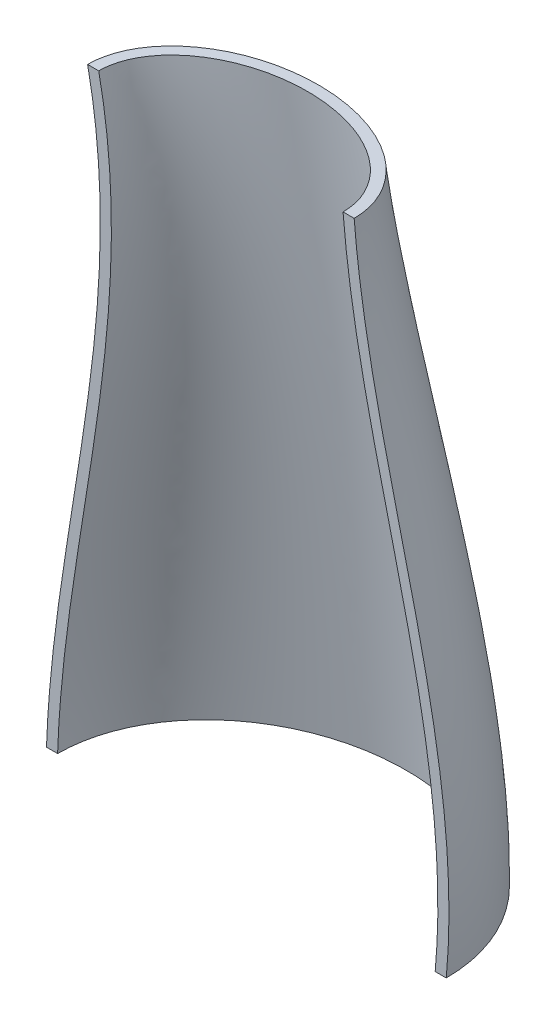
ISO-10303-21;
HEADER;
FILE_DESCRIPTION(('STEP AP214'),'2;1');
FILE_NAME('part.step','',(''),(''),'','','');
FILE_SCHEMA(('AUTOMOTIVE_DESIGN { 1 0 10303 214 1 1 1 1 }'));
ENDSEC;
DATA;
#1=APPLICATION_CONTEXT('core data for automotive mechanical design processes');
#2=APPLICATION_PROTOCOL_DEFINITION('international standard','automotive_design',2000,#1);
#3=PRODUCT_CONTEXT('',#1,'mechanical');
#4=PRODUCT('Part','Part','',(#3));
#5=PRODUCT_RELATED_PRODUCT_CATEGORY('part','',(#4));
#6=PRODUCT_DEFINITION_FORMATION('','',#4);
#7=PRODUCT_DEFINITION_CONTEXT('part definition',#1,'design');
#8=PRODUCT_DEFINITION('design','',#6,#7);
#9=PRODUCT_DEFINITION_SHAPE('','',#8);
#10=(LENGTH_UNIT() NAMED_UNIT(*) SI_UNIT(.MILLI.,.METRE.));
#11=(NAMED_UNIT(*) PLANE_ANGLE_UNIT() SI_UNIT($,.RADIAN.));
#12=(NAMED_UNIT(*) SI_UNIT($,.STERADIAN.) SOLID_ANGLE_UNIT());
#13=UNCERTAINTY_MEASURE_WITH_UNIT(LENGTH_MEASURE(1.E-05),#10,'distance_accuracy_value','');
#14=(GEOMETRIC_REPRESENTATION_CONTEXT(3) GLOBAL_UNCERTAINTY_ASSIGNED_CONTEXT((#13)) GLOBAL_UNIT_ASSIGNED_CONTEXT((#10,
#11,#12)) REPRESENTATION_CONTEXT('',''));
#15=CARTESIAN_POINT('',(0.,0.,0.));
#16=DIRECTION('',(0.,0.,1.));
#17=DIRECTION('',(1.,0.,0.));
#18=AXIS2_PLACEMENT_3D('',#15,#16,#17);
#19=CARTESIAN_POINT('',(0.,0.,0.));
#20=DIRECTION('',(0.,0.,1.));
#21=DIRECTION('',(1.,0.,0.));
#22=AXIS2_PLACEMENT_3D('',#19,#20,#21);
#23=PLANE('',#22);
#24=DIRECTION('',(1.,0.,0.));
#25=VECTOR('',#24,1.);
#26=CARTESIAN_POINT('',(-5.74133440751285,137.746177695902,0.));
#27=LINE('',#26,#25);
#28=CARTESIAN_POINT('',(-35.7453675505774,137.746177695902,0.));
#29=VERTEX_POINT('',#28);
#30=CARTESIAN_POINT('',(-33.2453675505774,137.746177695902,0.));
#31=VERTEX_POINT('',#30);
#32=EDGE_CURVE('E94',#29,#31,#27,.T.);
#33=ORIENTED_EDGE('',*,*,#32,.F.);
#34=CARTESIAN_POINT('',(-35.7453675505774,137.746177695902,0.));
#35=CARTESIAN_POINT('',(-35.5595474938632,136.852922609057,0.));
#36=CARTESIAN_POINT('',(-35.3835655688667,135.957633077733,0.));
#37=CARTESIAN_POINT('',(-35.0509249227353,134.163498430557,0.));
#38=CARTESIAN_POINT('',(-34.8942656055208,133.264653425269,0.));
#39=CARTESIAN_POINT('',(-34.6000545202637,131.464776426126,0.));
#40=CARTESIAN_POINT('',(-34.4624835908796,130.563747562841,0.));
#41=CARTESIAN_POINT('',(-34.2058339385276,128.759068113073,0.));
#42=CARTESIAN_POINT('',(-34.0867553604639,127.855417506104,0.));
#43=CARTESIAN_POINT('',(-33.7566342192219,125.141752197597,0.));
#44=CARTESIAN_POINT('',(-33.5726031495867,123.328388727618,0.));
#45=CARTESIAN_POINT('',(-33.2739291112574,119.715195430844,0.));
#46=CARTESIAN_POINT('',(-33.1585798192245,117.915422690675,0.));
#47=CARTESIAN_POINT('',(-32.9895886533308,114.31259407196,0.));
#48=CARTESIAN_POINT('',(-32.935961237129,112.509537523242,0.));
#49=CARTESIAN_POINT('',(-32.8854463467354,108.902575690908,0.));
#50=CARTESIAN_POINT('',(-32.8885631183912,107.098670353881,0.));
#51=CARTESIAN_POINT('',(-32.9644481886645,102.36011292607,0.));
#52=CARTESIAN_POINT('',(-33.0796895793198,99.4261129660154,0.));
#53=CARTESIAN_POINT('',(-33.4236415171862,93.5646145123182,0.));
#54=CARTESIAN_POINT('',(-33.6523740902568,90.6371173915413,0.));
#55=CARTESIAN_POINT('',(-34.2004194441202,84.7905710950553,0.));
#56=CARTESIAN_POINT('',(-34.5197397277337,81.8715226393354,0.));
#57=CARTESIAN_POINT('',(-35.2289195882609,76.023162613752,0.));
#58=CARTESIAN_POINT('',(-35.6192190740278,73.0939055525308,0.));
#59=CARTESIAN_POINT('',(-36.4469075840715,67.2425794491222,0.));
#60=CARTESIAN_POINT('',(-36.8842900886601,64.3205094688945,0.));
#61=CARTESIAN_POINT('',(-37.7848458839172,58.4800554366835,0.));
#62=CARTESIAN_POINT('',(-38.2480223005575,55.5616718754797,0.));
#63=CARTESIAN_POINT('',(-39.4126764861835,48.2614620508596,0.));
#64=CARTESIAN_POINT('',(-40.1171112609525,43.8800952730894,0.));
#65=CARTESIAN_POINT('',(-41.1278243241707,37.3016063549679,0.));
#66=CARTESIAN_POINT('',(-41.4570227906532,35.108057744502,0.));
#67=CARTESIAN_POINT('',(-42.0909372285906,30.7174443576782,0.));
#68=CARTESIAN_POINT('',(-42.3956537434673,28.5203796604709,0.));
#69=CARTESIAN_POINT('',(-42.9690037701936,24.1384342145933,0.));
#70=CARTESIAN_POINT('',(-43.2378933044445,21.953587361223,0.));
#71=CARTESIAN_POINT('',(-43.7327468230017,17.5791600237908,0.));
#72=CARTESIAN_POINT('',(-43.9587141940709,15.3895799270041,0.));
#73=CARTESIAN_POINT('',(-44.3582106390014,11.0025958695234,0.));
#74=CARTESIAN_POINT('',(-44.5316698070173,8.80518538520979,0.));
#75=CARTESIAN_POINT('',(-44.8156315553848,4.40570175686467,0.));
#76=CARTESIAN_POINT('',(-44.9261156673952,2.20362743493561,0.));
#77=CARTESIAN_POINT('',(-44.9999999999999,0.,0.));
#78=B_SPLINE_CURVE_WITH_KNOTS('',3,(#34,#35,#36,#37,#38,#39,#40,#41,#42,#43,#44,#45,#46,#47,#48,
#49,#50,#51,#52,#53,#54,#55,#56,#57,#58,#59,#60,#61,#62,#63,#64,#65,#66,#67,#68,#69,#70,#71,#72,
#73,#74,#75,#76,#77),.UNSPECIFIED.,.F.,.F.,(4,2,2,2,2,2,2,2,2,2,2,2,2,2,2,2,2,2,2,2,2,4),(0.,
2.73706078139401,5.47403710657353,8.20824580481467,10.9424759269644,16.4090068087981,
21.8183028142309,27.2288656290366,32.6398332874075,41.4456898934172,50.2532561694115,
59.0615521348109,67.9264249131878,76.7900717285387,85.6547950794237,98.9675740426821,
105.621818326582,112.2759148665,118.879568881186,125.482701619498,132.09458704296,
138.708410500624),.UNSPECIFIED.);
#79=CARTESIAN_POINT('',(-45.,0.,0.));
#80=VERTEX_POINT('',#79);
#81=EDGE_CURVE('E104',#29,#80,#78,.T.);
#82=ORIENTED_EDGE('',*,*,#81,.T.);
#83=DIRECTION('',(-1.,0.,0.));
#84=VECTOR('',#83,1.);
#85=CARTESIAN_POINT('',(-45.,0.,0.));
#86=LINE('',#85,#84);
#87=CARTESIAN_POINT('',(-42.5,0.,0.));
#88=VERTEX_POINT('',#87);
#89=EDGE_CURVE('E103',#88,#80,#86,.T.);
#90=ORIENTED_EDGE('',*,*,#89,.F.);
#91=CARTESIAN_POINT('',(-33.2453675505774,137.746177695902,0.));
#92=CARTESIAN_POINT('',(-23.7228053651667,91.9679244996649,0.));
#93=CARTESIAN_POINT('',(-40.9724969984661,45.5723941263997,0.));
#94=CARTESIAN_POINT('',(-42.5,0.,0.));
#95=B_SPLINE_CURVE_WITH_KNOTS('',3,(#91,#92,#93,#94),.UNSPECIFIED.,.F.,.F.,(4,4),(0.,1.),.UNSPECIFIED.);
#96=EDGE_CURVE('E87',#88,#31,#95,.F.);
#97=ORIENTED_EDGE('',*,*,#96,.T.);
#98=EDGE_LOOP('',(#33,#82,#90,#97));
#99=FACE_BOUND('',#98,.T.);
#100=ADVANCED_FACE('F36',(#99),#23,.T.);
#101=CARTESIAN_POINT('',(21.7626987355517,137.746177695902,0.));
#102=VERTEX_POINT('',#101);
#103=CARTESIAN_POINT('',(24.2626987355517,137.746177695902,0.));
#104=VERTEX_POINT('',#103);
#105=EDGE_CURVE('E98',#102,#104,#27,.T.);
#106=ORIENTED_EDGE('',*,*,#105,.F.);
#107=CARTESIAN_POINT('',(21.7626987355517,137.746177695902,0.));
#108=CARTESIAN_POINT('',(21.8542622747051,136.622462265402,0.));
#109=CARTESIAN_POINT('',(21.9561606690326,135.499626713591,0.));
#110=CARTESIAN_POINT('',(22.1794109192749,133.255942133521,0.));
#111=CARTESIAN_POINT('',(22.3007618422226,132.135093012595,0.));
#112=CARTESIAN_POINT('',(22.6921027544701,128.776400754926,0.));
#113=CARTESIAN_POINT('',(22.9894393760284,126.541713246958,0.));
#114=CARTESIAN_POINT('',(23.6460661237931,122.088330462632,0.));
#115=CARTESIAN_POINT('',(24.0051711569487,119.869607467939,0.));
#116=CARTESIAN_POINT('',(24.7759508582164,115.44127104607,0.));
#117=CARTESIAN_POINT('',(25.1876279798628,113.23165804903,0.));
#118=CARTESIAN_POINT('',(26.5209266220415,106.44027736159,0.));
#119=CARTESIAN_POINT('',(27.5133221204681,101.872519176814,0.));
#120=CARTESIAN_POINT('',(29.5944724178173,92.7587961077402,0.));
#121=CARTESIAN_POINT('',(30.6832489370951,88.212836380498,0.));
#122=CARTESIAN_POINT('',(32.8728274763162,79.1171930939584,0.));
#123=CARTESIAN_POINT('',(33.9736440982213,74.5675131320239,0.));
#124=CARTESIAN_POINT('',(36.0995265453355,65.4508566176189,0.));
#125=CARTESIAN_POINT('',(37.1246091106237,60.8838841234833,0.));
#126=CARTESIAN_POINT('',(38.539129650978,54.0074303232394,0.));
#127=CARTESIAN_POINT('',(38.9901535975966,51.7107430205107,0.));
#128=CARTESIAN_POINT('',(39.839714743747,47.107519319292,0.));
#129=CARTESIAN_POINT('',(40.2382503111579,44.8009826168373,0.));
#130=CARTESIAN_POINT('',(40.9707694798854,40.1808565825125,0.));
#131=CARTESIAN_POINT('',(41.3048415740079,37.8672814118214,0.));
#132=CARTESIAN_POINT('',(41.8976056477479,33.2302715062465,0.));
#133=CARTESIAN_POINT('',(42.1562959465463,30.9068365526868,0.));
#134=CARTESIAN_POINT('',(42.5178205772586,26.9995817251936,0.));
#135=CARTESIAN_POINT('',(42.6440268148776,25.4179120854782,0.));
#136=CARTESIAN_POINT('',(42.8531222224539,22.2517105546818,0.));
#137=CARTESIAN_POINT('',(42.9360124999787,20.667178737825,0.));
#138=CARTESIAN_POINT('',(43.0552589068098,17.4965404636477,0.));
#139=CARTESIAN_POINT('',(43.0916210150835,15.9104342348625,0.));
#140=CARTESIAN_POINT('',(43.1149230223741,12.7310076720311,0.));
#141=CARTESIAN_POINT('',(43.1016494557444,11.1376856803827,0.));
#142=CARTESIAN_POINT('',(43.0225168594514,7.9520226029834,0.));
#143=CARTESIAN_POINT('',(42.9566491885177,6.35968172145888,0.));
#144=CARTESIAN_POINT('',(42.8166814199491,3.97319010331323,0.));
#145=CARTESIAN_POINT('',(42.7631423107808,3.17779228541036,0.));
#146=CARTESIAN_POINT('',(42.6421013987205,1.58804715942509,0.));
#147=CARTESIAN_POINT('',(42.5745993631829,0.793699869068197,0.));
#148=CARTESIAN_POINT('',(42.5,0.,0.));
#149=B_SPLINE_CURVE_WITH_KNOTS('',3,(#107,#108,#109,#110,#111,#112,#113,#114,#115,#116,#117,
#118,#119,#120,#121,#122,#123,#124,#125,#126,#127,#128,#129,#130,#131,#132,#133,#134,#135,#136,
#137,#138,#139,#140,#141,#142,#143,#144,#145,#146,#147,#148),.UNSPECIFIED.,.F.,.F.,(4,2,2,2,2,2,
2,2,2,2,2,2,2,2,2,2,2,2,2,2,4),(0.,3.38220847530561,6.76425478427519,13.5262427338768,
20.268310135906,27.0106923046422,41.0310366834324,55.0545487597252,69.0975381554799,
83.1374141769162,90.1585896862525,97.1799834668232,104.191668904945,111.203510673558,
115.96308261272,120.722532846049,125.481371418592,130.26069957902,135.040813150051,
137.432298710414,139.823824120133),.UNSPECIFIED.);
#150=CARTESIAN_POINT('',(42.5,0.,0.));
#151=VERTEX_POINT('',#150);
#152=EDGE_CURVE('E89',#102,#151,#149,.T.);
#153=ORIENTED_EDGE('',*,*,#152,.T.);
#154=CARTESIAN_POINT('',(45.,0.,-2.25145141930639E-06));
#155=VERTEX_POINT('',#154);
#156=EDGE_CURVE('E233',#155,#151,#86,.T.);
#157=ORIENTED_EDGE('',*,*,#156,.F.);
#158=CARTESIAN_POINT('',(45.,0.,-2.25145142243241E-06));
#159=CARTESIAN_POINT('',(49.4561709237232,47.413664139623,0.));
#160=CARTESIAN_POINT('',(28.054924480837,91.2082843321231,0.));
#161=CARTESIAN_POINT('',(24.2626987355517,137.746177695902,0.));
#162=B_SPLINE_CURVE_WITH_KNOTS('',3,(#158,#159,#160,#161),.UNSPECIFIED.,.F.,.F.,(4,4),(0.,1.),.UNSPECIFIED.);
#163=EDGE_CURVE('E99',#155,#104,#162,.T.);
#164=ORIENTED_EDGE('',*,*,#163,.T.);
#165=EDGE_LOOP('',(#106,#153,#157,#164));
#166=FACE_BOUND('',#165,.T.);
#167=ADVANCED_FACE('F142',(#166),#23,.T.);
#168=CARTESIAN_POINT('',(-5.74133440751285,137.746177695902,0.));
#169=DIRECTION('',(0.,1.,0.));
#170=DIRECTION('',(0.,0.,1.));
#171=AXIS2_PLACEMENT_3D('',#168,#169,#170);
#172=PLANE('',#171);
#173=CARTESIAN_POINT('',(-5.74133440751285,137.746177695902,0.));
#174=DIRECTION('',(0.,1.,0.));
#175=DIRECTION('',(-1.,0.,0.));
#176=AXIS2_PLACEMENT_3D('',#173,#174,#175);
#177=ELLIPSE('',#176,30.0040331430646,22.);
#178=EDGE_CURVE('E57',#104,#29,#177,.T.);
#179=ORIENTED_EDGE('',*,*,#178,.T.);
#180=ORIENTED_EDGE('',*,*,#32,.T.);
#181=CARTESIAN_POINT('',(-33.2453675505774,137.746177695902,0.));
#182=CARTESIAN_POINT('',(-33.2453675505774,137.746177695902,2.43833133979085));
#183=CARTESIAN_POINT('',(-31.9453278655088,137.746177695902,7.31499401937254));
#184=CARTESIAN_POINT('',(-26.031832939099,137.746177695902,13.8763950578892));
#185=CARTESIAN_POINT('',(-16.8019990969306,137.746177695902,18.4208773117443));
#186=CARTESIAN_POINT('',(-5.74133440751285,137.746177695902,20.0395613441279));
#187=CARTESIAN_POINT('',(5.31933028190485,137.746177695902,18.4208773117443));
#188=CARTESIAN_POINT('',(14.5491641240734,137.746177695902,13.8763950578892));
#189=CARTESIAN_POINT('',(20.4626590504831,137.746177695902,7.31499401937254));
#190=CARTESIAN_POINT('',(22.4127185780861,137.746177695902,0.));
#191=CARTESIAN_POINT('',(20.4626590504831,137.746177695902,-7.31499401937254));
#192=CARTESIAN_POINT('',(14.5491641240734,137.746177695902,-13.8763950578892));
#193=CARTESIAN_POINT('',(5.31933028190486,137.746177695902,-18.4208773117443));
#194=CARTESIAN_POINT('',(-5.74133440751285,137.746177695902,-20.0395613441279));
#195=CARTESIAN_POINT('',(-16.8019990969306,137.746177695902,-18.4208773117443));
#196=CARTESIAN_POINT('',(-26.031832939099,137.746177695902,-13.8763950578892));
#197=CARTESIAN_POINT('',(-31.9453278655088,137.746177695902,-7.31499401937255));
#198=CARTESIAN_POINT('',(-33.2453675505774,137.746177695902,-2.43833133979085));
#199=CARTESIAN_POINT('',(-33.2453675505774,137.746177695902,0.));
#200=B_SPLINE_CURVE_WITH_KNOTS('',3,(#181,#182,#183,#184,#185,#186,#187,#188,#189,#190,#191,
#192,#193,#194,#195,#196,#197,#198,#199),.UNSPECIFIED.,.T.,.F.,(4,1,1,1,1,1,1,1,1,1,1,1,1,1,1,1,
4),(0.,0.392699081698724,0.785398163397448,1.17809724509617,1.5707963267949,1.96349540849362,
2.35619449019234,2.74889357189107,3.14159265358979,3.53429173528852,3.92699081698724,
4.31968989868597,4.71238898038469,5.10508806208341,5.49778714378214,5.89048622548086,
6.28318530717959),.UNSPECIFIED.);
#201=EDGE_CURVE('E11',#102,#31,#200,.T.);
#202=ORIENTED_EDGE('',*,*,#201,.F.);
#203=ORIENTED_EDGE('',*,*,#105,.T.);
#204=EDGE_LOOP('',(#179,#180,#202,#203));
#205=FACE_BOUND('',#204,.T.);
#206=ADVANCED_FACE('F95',(#205),#172,.T.);
#207=CARTESIAN_POINT('',(-45.,0.,0.));
#208=DIRECTION('',(0.,-1.,0.));
#209=DIRECTION('',(0.,0.,-1.));
#210=AXIS2_PLACEMENT_3D('',#207,#208,#209);
#211=PLANE('',#210);
#212=CARTESIAN_POINT('',(45.,0.,0.));
#213=CARTESIAN_POINT('',(45.,0.,-5.09667683118605));
#214=CARTESIAN_POINT('',(42.5976801144453,0.,-15.2900304935582));
#215=CARTESIAN_POINT('',(32.4725636829298,0.,-28.0888828645692));
#216=CARTESIAN_POINT('',(17.5194628961023,0.,-36.5351878660463));
#217=CARTESIAN_POINT('',(0.,0.,-39.4824060669769));
#218=CARTESIAN_POINT('',(-17.5194628961023,0.,-36.5351878660463));
#219=CARTESIAN_POINT('',(-32.4725636829298,0.,-28.0888828645692));
#220=CARTESIAN_POINT('',(-41.753920411819,0.,-16.3566015244757));
#221=CARTESIAN_POINT('',(-45.073774536095,0.,-5.12550667548267));
#222=CARTESIAN_POINT('',(-45.073774536095,0.,5.12550667548266));
#223=CARTESIAN_POINT('',(-41.753920411819,0.,16.3566015244757));
#224=CARTESIAN_POINT('',(-32.4725636829298,0.,28.0888828645692));
#225=CARTESIAN_POINT('',(-17.5194628961023,0.,36.5351878660463));
#226=CARTESIAN_POINT('',(0.,0.,39.4824060669769));
#227=CARTESIAN_POINT('',(17.5194628961023,0.,36.5351878660463));
#228=CARTESIAN_POINT('',(32.4725636829298,0.,28.0888828645692));
#229=CARTESIAN_POINT('',(42.5976801144453,0.,15.2900304935582));
#230=CARTESIAN_POINT('',(45.,0.,5.09667683118606));
#231=CARTESIAN_POINT('',(45.,0.,0.));
#232=B_SPLINE_CURVE_WITH_KNOTS('',3,(#212,#213,#214,#215,#216,#217,#218,#219,#220,#221,#222,
#223,#224,#225,#226,#227,#228,#229,#230,#231),.UNSPECIFIED.,.T.,.F.,(4,1,1,1,1,1,1,1,1,1,1,1,1,
1,1,1,1,4),(0.,0.392699081698724,0.785398163397448,1.17809724509617,1.5707963267949,
1.96349540849362,2.35619449019234,2.74889357189107,3.04341788316511,3.23976742401447,
3.53429173528852,3.92699081698724,4.31968989868597,4.71238898038469,5.10508806208341,
5.49778714378214,5.89048622548086,6.28318530717959),.UNSPECIFIED.);
#233=EDGE_CURVE('E218',#155,#80,#232,.T.);
#234=ORIENTED_EDGE('',*,*,#233,.F.);
#235=ORIENTED_EDGE('',*,*,#156,.T.);
#236=CARTESIAN_POINT('',(0.,0.,0.));
#237=DIRECTION('',(0.,1.,0.));
#238=DIRECTION('',(1.,0.,0.));
#239=AXIS2_PLACEMENT_3D('',#236,#237,#238);
#240=ELLIPSE('',#239,42.5,36.);
#241=EDGE_CURVE('E49',#151,#88,#240,.T.);
#242=ORIENTED_EDGE('',*,*,#241,.T.);
#243=ORIENTED_EDGE('',*,*,#89,.T.);
#244=EDGE_LOOP('',(#234,#235,#242,#243));
#245=FACE_BOUND('',#244,.T.);
#246=ADVANCED_FACE('F147',(#245),#211,.T.);
#247=CARTESIAN_POINT('',(-33.2453675505774,137.746177695902,0.));
#248=CARTESIAN_POINT('',(-23.7228053651667,91.9679244996649,0.));
#249=CARTESIAN_POINT('',(-40.9724969984661,45.5723941263997,0.));
#250=CARTESIAN_POINT('',(-42.5,0.,0.));
#251=CARTESIAN_POINT('',(-33.2453675505774,137.746177695902,-1.54825783950049));
#252=CARTESIAN_POINT('',(-23.7228053651667,91.9679244996649,-1.88994244151252));
#253=CARTESIAN_POINT('',(-40.9724969984661,45.5723941263997,-2.23162704352454));
#254=CARTESIAN_POINT('',(-42.5,0.,-2.57331164553657));
#255=CARTESIAN_POINT('',(-32.7098210924575,137.746177695902,-4.64325631327882));
#256=CARTESIAN_POINT('',(-23.2695529682641,91.9619898108559,-5.66854820561216));
#257=CARTESIAN_POINT('',(-40.2548099556221,45.5867790483779,-6.69384009794551));
#258=CARTESIAN_POINT('',(-41.8427189830769,0.,-7.71913199027887));
#259=CARTESIAN_POINT('',(-30.5012643255426,137.746177695902,-8.78393459659462));
#260=CARTESIAN_POINT('',(-21.3551947403749,91.9375092195193,-10.8412062502514));
#261=CARTESIAN_POINT('',(-37.2043943497291,45.6461168515385,-12.8984779039082));
#262=CARTESIAN_POINT('',(-38.9962137706121,0.,-14.955749557565));
#263=CARTESIAN_POINT('',(-27.3474167026364,137.746177695902,-12.2322468601319));
#264=CARTESIAN_POINT('',(-18.5642254606363,91.8996755783624,-15.2696922652504));
#265=CARTESIAN_POINT('',(-32.5659079050216,45.7378207291502,-18.307137670369));
#266=CARTESIAN_POINT('',(-34.5810694440578,0.,-21.3445830754876));
#267=CARTESIAN_POINT('',(-23.568249482996,137.746177695902,-14.9665037497497));
#268=CARTESIAN_POINT('',(-15.1784911693603,91.8507143956888,-18.868641779544));
#269=CARTESIAN_POINT('',(-26.7130947080509,45.8564963354713,-22.7707798093383));
#270=CARTESIAN_POINT('',(-28.9411128842564,0.,-26.6729178391327));
#271=CARTESIAN_POINT('',(-19.3898698752269,137.746177695902,-17.026316924509));
#272=CARTESIAN_POINT('',(-11.413412030291,91.7928511798018,-21.6316876165057));
#273=CARTESIAN_POINT('',(-19.9807111428842,45.9967493247597,-26.2370583085024));
#274=CARTESIAN_POINT('',(-22.4086214436498,0.,-30.8424290004991));
#275=CARTESIAN_POINT('',(-14.9628250716892,137.746177695902,-18.4667099237038));
#276=CARTESIAN_POINT('',(-7.41343290000779,91.7283114390048,-23.584638169307));
#277=CARTESIAN_POINT('',(-12.6371229955048,46.1531853512738,-28.7025664149101));
#278=CARTESIAN_POINT('',(-15.2540665856768,0.,-33.8204946605132));
#279=CARTESIAN_POINT('',(-10.3857607589648,137.746177695902,-19.3095786456236));
#280=CARTESIAN_POINT('',(-3.2796006999164,91.659320681601,-24.7411682902245));
#281=CARTESIAN_POINT('',(-4.91580168732677,46.3204100692716,-30.1727579348254));
#282=CARTESIAN_POINT('',(-7.72152897981141,0.,-35.6043475794263));
#283=CARTESIAN_POINT('',(-5.74133440751282,137.746177695902,-19.5954616478669));
#284=CARTESIAN_POINT('',(0.916059557835182,91.5881044158941,-25.1295480497805));
#285=CARTESIAN_POINT('',(2.99183696262859,46.4930291330114,-30.6636344516941));
#286=CARTESIAN_POINT('',(0.,0.,-36.1977208536077));
#287=CARTESIAN_POINT('',(-1.09690805606086,137.746177695902,-19.3095786456236));
#288=CARTESIAN_POINT('',(5.11171981558672,91.516888150187,-24.7411682902245));
#289=CARTESIAN_POINT('',(10.8994756125839,46.6656481967511,-30.1727579348254));
#290=CARTESIAN_POINT('',(7.72152897981145,0.,-35.6043475794263));
#291=CARTESIAN_POINT('',(3.48015625666354,137.746177695902,-18.4667099237039));
#292=CARTESIAN_POINT('',(9.24555201567807,91.4478973927832,-23.584638169307));
#293=CARTESIAN_POINT('',(18.6207969207618,46.8328729147488,-28.7025664149101));
#294=CARTESIAN_POINT('',(15.2540665856767,0.,-33.8204946605132));
#295=CARTESIAN_POINT('',(7.9072010602012,137.746177695902,-17.026316924509));
#296=CARTESIAN_POINT('',(13.2455311459613,91.3833576519863,-21.6316876165057));
#297=CARTESIAN_POINT('',(25.9643850681413,46.989308941263,-26.2370583085024));
#298=CARTESIAN_POINT('',(22.4086214436499,0.,-30.8424290004991));
#299=CARTESIAN_POINT('',(12.0855806679703,137.746177695902,-14.9665037497497));
#300=CARTESIAN_POINT('',(17.0106102850306,91.3254944360992,-18.868641779544));
#301=CARTESIAN_POINT('',(32.6967686333079,47.1295619305514,-22.7707798093383));
#302=CARTESIAN_POINT('',(28.9411128842563,0.,-26.6729178391325));
#303=CARTESIAN_POINT('',(15.8647478876107,137.746177695902,-12.2322468601318));
#304=CARTESIAN_POINT('',(20.3963445763067,91.2765332534256,-15.2696922652504));
#305=CARTESIAN_POINT('',(38.5495818302788,47.2482375368724,-18.307137670369));
#306=CARTESIAN_POINT('',(34.581069444058,0.,-21.3445830754877));
#307=CARTESIAN_POINT('',(19.018595510517,137.746177695903,-8.78393459659464));
#308=CARTESIAN_POINT('',(23.1873138560452,91.238699612269,-10.8412062502514));
#309=CARTESIAN_POINT('',(43.1880682749861,47.3399414144843,-12.8984779039081));
#310=CARTESIAN_POINT('',(38.9962137706119,0.,-14.9557495575648));
#311=CARTESIAN_POINT('',(21.2271522774318,137.746177695902,-4.64325631327874));
#312=CARTESIAN_POINT('',(25.1016720839344,91.2142190209319,-5.66854820561213));
#313=CARTESIAN_POINT('',(46.2384838808792,47.3992792176446,-6.69384009794551));
#314=CARTESIAN_POINT('',(41.842718983077,0.,-7.71913199027889));
#315=CARTESIAN_POINT('',(21.7626987355517,137.746177695902,-1.54825783950049));
#316=CARTESIAN_POINT('',(25.554924480837,91.2082843321231,-1.88994244151252));
#317=CARTESIAN_POINT('',(46.9561709237232,47.413664139623,-2.23162704352454));
#318=CARTESIAN_POINT('',(42.5,0.,-2.57331164553657));
#319=CARTESIAN_POINT('',(21.7626987355517,137.746177695902,1.54825783950049));
#320=CARTESIAN_POINT('',(25.554924480837,91.2082843321231,1.88994244151251));
#321=CARTESIAN_POINT('',(46.9561709237232,47.413664139623,2.23162704352454));
#322=CARTESIAN_POINT('',(42.5,0.,2.57331164553657));
#323=CARTESIAN_POINT('',(21.2271522774318,137.746177695902,4.64325631327881));
#324=CARTESIAN_POINT('',(25.1016720839343,91.2142190209318,5.66854820561216));
#325=CARTESIAN_POINT('',(46.2384838808791,47.3992792176446,6.69384009794552));
#326=CARTESIAN_POINT('',(41.8427189830769,0.,7.71913199027889));
#327=CARTESIAN_POINT('',(19.0185955105169,137.746177695903,8.7839345965946));
#328=CARTESIAN_POINT('',(23.1873138560452,91.2386996122691,10.8412062502514));
#329=CARTESIAN_POINT('',(43.1880682749862,47.3399414144843,12.8984779039081));
#330=CARTESIAN_POINT('',(38.9962137706121,0.,14.9557495575649));
#331=CARTESIAN_POINT('',(15.8647478876107,137.746177695902,12.2322468601319));
#332=CARTESIAN_POINT('',(20.3963445763066,91.2765332534254,15.2696922652505));
#333=CARTESIAN_POINT('',(38.5495818302786,47.2482375368723,18.307137670369));
#334=CARTESIAN_POINT('',(34.5810694440578,0.,21.3445830754876));
#335=CARTESIAN_POINT('',(12.0855806679703,137.746177695903,14.9665037497497));
#336=CARTESIAN_POINT('',(17.0106102850306,91.3254944360997,18.868641779544));
#337=CARTESIAN_POINT('',(32.696768633308,47.1295619305516,22.7707798093383));
#338=CARTESIAN_POINT('',(28.9411128842564,0.,26.6729178391326));
#339=CARTESIAN_POINT('',(7.90720106020117,137.746177695902,17.026316924509));
#340=CARTESIAN_POINT('',(13.2455311459613,91.3833576519859,21.6316876165057));
#341=CARTESIAN_POINT('',(25.9643850681412,46.9893089412628,26.2370583085024));
#342=CARTESIAN_POINT('',(22.4086214436498,0.,30.8424290004991));
#343=CARTESIAN_POINT('',(3.48015625666352,137.746177695903,18.4667099237038));
#344=CARTESIAN_POINT('',(9.24555201567806,91.4478973927836,23.584638169307));
#345=CARTESIAN_POINT('',(18.6207969207618,46.832872914749,28.7025664149101));
#346=CARTESIAN_POINT('',(15.2540665856768,0.,33.8204946605132));
#347=CARTESIAN_POINT('',(-1.09690805606092,137.746177695902,19.3095786456237));
#348=CARTESIAN_POINT('',(5.11171981558666,91.5168881501866,24.7411682902246));
#349=CARTESIAN_POINT('',(10.8994756125838,46.6656481967509,30.1727579348255));
#350=CARTESIAN_POINT('',(7.72152897981141,0.,35.6043475794264));
#351=CARTESIAN_POINT('',(-5.74133440751286,137.746177695903,19.5954616478668));
#352=CARTESIAN_POINT('',(0.916059557835101,91.5881044158943,25.1295480497805));
#353=CARTESIAN_POINT('',(2.99183696262847,46.4930291330115,30.6636344516941));
#354=CARTESIAN_POINT('',(0.,0.,36.1977208536077));
#355=CARTESIAN_POINT('',(-10.3857607589649,137.746177695902,19.3095786456236));
#356=CARTESIAN_POINT('',(-3.27960069991649,91.6593206816008,24.7411682902245));
#357=CARTESIAN_POINT('',(-4.91580168732685,46.3204100692715,30.1727579348254));
#358=CARTESIAN_POINT('',(-7.7215289798115,0.,35.6043475794263));
#359=CARTESIAN_POINT('',(-14.9628250716892,137.746177695903,18.4667099237039));
#360=CARTESIAN_POINT('',(-7.41343290000779,91.728311439005,23.584638169307));
#361=CARTESIAN_POINT('',(-12.6371229955048,46.1531853512739,28.7025664149101));
#362=CARTESIAN_POINT('',(-15.2540665856768,0.,33.8204946605131));
#363=CARTESIAN_POINT('',(-19.3898698752269,137.746177695902,17.026316924509));
#364=CARTESIAN_POINT('',(-11.413412030291,91.7928511798016,21.6316876165057));
#365=CARTESIAN_POINT('',(-19.9807111428842,45.9967493247596,26.2370583085024));
#366=CARTESIAN_POINT('',(-22.4086214436498,0.,30.8424290004991));
#367=CARTESIAN_POINT('',(-23.568249482996,137.746177695903,14.9665037497497));
#368=CARTESIAN_POINT('',(-15.1784911693604,91.8507143956891,18.8686417795439));
#369=CARTESIAN_POINT('',(-26.7130947080509,45.8564963354714,22.7707798093382));
#370=CARTESIAN_POINT('',(-28.9411128842565,0.,26.6729178391325));
#371=CARTESIAN_POINT('',(-27.3474167026364,137.746177695902,12.2322468601318));
#372=CARTESIAN_POINT('',(-18.5642254606364,91.8996755783619,15.2696922652505));
#373=CARTESIAN_POINT('',(-32.5659079050216,45.73782072915,18.3071376703691));
#374=CARTESIAN_POINT('',(-34.5810694440578,0.,21.3445830754877));
#375=CARTESIAN_POINT('',(-30.5012643255427,137.746177695903,8.7839345965946));
#376=CARTESIAN_POINT('',(-21.3551947403749,91.9375092195197,10.8412062502513));
#377=CARTESIAN_POINT('',(-37.204394349729,45.6461168515387,12.8984779039081));
#378=CARTESIAN_POINT('',(-38.996213770612,0.,14.9557495575648));
#379=CARTESIAN_POINT('',(-32.7098210924575,137.746177695902,4.64325631327878));
#380=CARTESIAN_POINT('',(-23.2695529682641,91.9619898108558,5.66854820561217));
#381=CARTESIAN_POINT('',(-40.2548099556221,45.5867790483778,6.69384009794555));
#382=CARTESIAN_POINT('',(-41.842718983077,0.,7.71913199027893));
#383=CARTESIAN_POINT('',(-33.2453675505774,137.746177695902,1.54825783950049));
#384=CARTESIAN_POINT('',(-23.7228053651667,91.9679244996649,1.88994244151252));
#385=CARTESIAN_POINT('',(-40.9724969984661,45.5723941263997,2.23162704352454));
#386=CARTESIAN_POINT('',(-42.5,0.,2.57331164553656));
#387=CARTESIAN_POINT('',(-33.2453675505774,137.746177695902,0.));
#388=CARTESIAN_POINT('',(-23.7228053651667,91.9679244996649,0.));
#389=CARTESIAN_POINT('',(-40.9724969984661,45.5723941263997,0.));
#390=CARTESIAN_POINT('',(-42.5,0.,0.));
#391=B_SPLINE_SURFACE_WITH_KNOTS('',3,3,((#247,#248,#249,#250),(#251,#252,#253,#254),(#255,#256,
#257,#258),(#259,#260,#261,#262),(#263,#264,#265,#266),(#267,#268,#269,#270),(#271,#272,#273,
#274),(#275,#276,#277,#278),(#279,#280,#281,#282),(#283,#284,#285,#286),(#287,#288,#289,#290),
(#291,#292,#293,#294),(#295,#296,#297,#298),(#299,#300,#301,#302),(#303,#304,#305,#306),(#307,
#308,#309,#310),(#311,#312,#313,#314),(#315,#316,#317,#318),(#319,#320,#321,#322),(#323,#324,
#325,#326),(#327,#328,#329,#330),(#331,#332,#333,#334),(#335,#336,#337,#338),(#339,#340,#341,
#342),(#343,#344,#345,#346),(#347,#348,#349,#350),(#351,#352,#353,#354),(#355,#356,#357,#358),
(#359,#360,#361,#362),(#363,#364,#365,#366),(#367,#368,#369,#370),(#371,#372,#373,#374),(#375,
#376,#377,#378),(#379,#380,#381,#382),(#383,#384,#385,#386),(#387,#388,#389,#390)),
.UNSPECIFIED.,.T.,.F.,.F.,(4,1,1,1,1,1,1,1,1,1,1,1,1,1,1,1,2,1,1,1,1,1,1,1,1,1,1,1,1,1,1,1,4),
(4,4),(0.,0.03125,0.0625,0.09375,0.125,0.15625,0.1875,0.21875,0.25,0.28125,0.3125,0.34375,0.375,
0.40625,0.4375,0.46875,0.5,0.53125,0.5625,0.59375,0.625,0.65625,0.6875,0.71875,0.75,0.78125,
0.8125,0.84375,0.875,0.90625,0.9375,0.96875,1.),(0.,1.),.UNSPECIFIED.);
#392=ORIENTED_EDGE('',*,*,#96,.F.);
#393=ORIENTED_EDGE('',*,*,#241,.F.);
#394=ORIENTED_EDGE('',*,*,#152,.F.);
#395=ORIENTED_EDGE('',*,*,#201,.T.);
#396=EDGE_LOOP('',(#392,#393,#394,#395));
#397=FACE_BOUND('',#396,.T.);
#398=ADVANCED_FACE('F85',(#397),#391,.F.);
#399=CARTESIAN_POINT('',(45.,0.,-2.25145142243241E-06));
#400=CARTESIAN_POINT('',(49.4561709237232,47.413664139623,0.));
#401=CARTESIAN_POINT('',(28.054924480837,91.2082843321231,0.));
#402=CARTESIAN_POINT('',(24.2626987355517,137.746177695902,0.));
#403=CARTESIAN_POINT('',(45.,0.,-2.73686717661151));
#404=CARTESIAN_POINT('',(49.4561709237232,47.413664139623,-2.39521691580166));
#405=CARTESIAN_POINT('',(28.054924480837,91.2082843321231,-2.05356890644323));
#406=CARTESIAN_POINT('',(24.2626987355517,137.746177695902,-1.7119208970848));
#407=CARTESIAN_POINT('',(44.3057460111731,0.,-8.20859539809534));
#408=CARTESIAN_POINT('',(48.7072688874213,47.3992792176447,-7.18354495476638));
#409=CARTESIAN_POINT('',(27.5762150689226,91.2142190209318,-6.15849676288885));
#410=CARTESIAN_POINT('',(23.7074532408661,137.746177695902,-5.13344857101131));
#411=CARTESIAN_POINT('',(41.3339830567258,0.,-15.9245230795289));
#412=CARTESIAN_POINT('',(45.5398069001061,47.3399414144843,-13.8755689558452));
#413=CARTESIAN_POINT('',(25.5530218201714,91.238699612269,-11.8266170836128));
#414=CARTESIAN_POINT('',(21.3982728136493,137.746177695903,-9.77766521138045));
#415=CARTESIAN_POINT('',(36.682542208869,0.,-22.751088411424));
#416=CARTESIAN_POINT('',(40.6670012196418,47.2482375368724,-19.7286880700159));
#417=CARTESIAN_POINT('',(22.5297105902217,91.2765332534254,-16.7062899800593));
#418=CARTESIAN_POINT('',(18.0140605260778,137.746177695902,-13.6838918901026));
#419=CARTESIAN_POINT('',(30.7343092374187,0.,-28.4683400546408));
#420=CARTESIAN_POINT('',(34.4988151843393,47.1295619305516,-24.5801145128701));
#421=CARTESIAN_POINT('',(18.821507033931,91.3254944360995,-20.6918912225508));
#422=CARTESIAN_POINT('',(13.9053276147397,137.746177695903,-16.8036679322315));
#423=CARTESIAN_POINT('',(23.8086999335155,0.,-32.943452438197));
#424=CARTESIAN_POINT('',(27.3707858162273,46.9893089412629,-28.3505168155687));
#425=CARTESIAN_POINT('',(14.6582541522677,91.3833576519861,-23.7575834443918));
#426=CARTESIAN_POINT('',(9.32624632472796,137.746177695902,-19.164650073215));
#427=CARTESIAN_POINT('',(16.2212799688463,0.,-36.1545026262331));
#428=CARTESIAN_POINT('',(19.5883407403824,46.8328729147488,-31.0405743796246));
#429=CARTESIAN_POINT('',(10.2134262717497,91.4478973927832,-25.9266483844675));
#430=CARTESIAN_POINT('',(4.44836094918624,137.746177695902,-20.8127223893104));
#431=CARTESIAN_POINT('',(8.20929478909903,0.,-38.068987669668));
#432=CARTESIAN_POINT('',(11.3884533789176,46.665648196751,-32.6411715641088));
#433=CARTESIAN_POINT('',(5.60190953896658,91.5168881501869,-27.2133577100009));
#434=CARTESIAN_POINT('',(-0.605506375634823,137.746177695902,-21.7855438558931));
#435=CARTESIAN_POINT('',(-0.000614732027113749,0.,-38.7156778606779));
#436=CARTESIAN_POINT('',(2.99142714127709,46.4930291330113,-33.1795176782209));
#437=CARTESIAN_POINT('',(0.915854647159431,91.588104415894,-27.6433597472152));
#438=CARTESIAN_POINT('',(-5.74133440751282,137.746177695902,-22.1072018162096));
#439=CARTESIAN_POINT('',(-8.21062839554504,0.,-38.0687850929858));
#440=CARTESIAN_POINT('',(-5.40566852462459,46.3204100692717,-32.6410365129873));
#441=CARTESIAN_POINT('',(-3.77023495877836,91.6593206816012,-27.2132901844402));
#442=CARTESIAN_POINT('',(-10.8771624393909,137.746177695903,-21.7855438558931));
#443=CARTESIAN_POINT('',(-16.2224000346934,0.,-36.1541109896919));
#444=CARTESIAN_POINT('',(-13.6054135256902,46.1531853512738,-31.0403132885971));
#445=CARTESIAN_POINT('',(-8.38168051136185,91.7283114390046,-25.9265178389538));
#446=CARTESIAN_POINT('',(-15.9310297642119,137.746177695902,-20.8127223893104));
#447=CARTESIAN_POINT('',(-23.8100058350482,0.,-32.9428392595297));
#448=CARTESIAN_POINT('',(-21.3879824919921,45.9967493247598,-28.3501080297905));
#449=CARTESIAN_POINT('',(-12.8265703371083,91.7928511798019,-23.7573790515028));
#450=CARTESIAN_POINT('',(-20.8089151397536,137.746177695903,-19.164650073215));
#451=CARTESIAN_POINT('',(-30.7350794692783,0.,-28.4675670066756));
#452=CARTESIAN_POINT('',(-28.5156547469886,45.8564963354712,-24.5795991475599));
#453=CARTESIAN_POINT('',(-16.9896446622139,91.8507143956886,-20.6916335398957));
#454=CARTESIAN_POINT('',(-25.3879964297653,137.746177695902,-16.8036679322315));
#455=CARTESIAN_POINT('',(-36.6837771732156,0.,-22.7500559954045));
#456=CARTESIAN_POINT('',(-34.6841506039492,45.7378207291503,-19.7279997926696));
#457=CARTESIAN_POINT('',(-20.6980031293337,91.8996755783625,-16.7059458413861));
#458=CARTESIAN_POINT('',(-29.4967293411035,137.746177695903,-13.6838918901026));
#459=CARTESIAN_POINT('',(-41.3344397309365,0.,-15.9240138472673));
#460=CARTESIAN_POINT('',(-39.5564374243229,45.6461168515383,-13.8752294676708));
#461=CARTESIAN_POINT('',(-23.721054929238,91.9375092195189,-11.8264473395256));
#462=CARTESIAN_POINT('',(-32.8809416286749,137.746177695902,-9.77766521138042));
#463=CARTESIAN_POINT('',(-44.3120314139607,0.,-8.20938990686695));
#464=CARTESIAN_POINT('',(-42.7277852306894,45.5867790483781,-7.1840746272808));
#465=CARTESIAN_POINT('',(-25.7461910875149,91.9619898108562,-6.15876159914607));
#466=CARTESIAN_POINT('',(-35.1901220558918,137.746177695903,-5.13344857101133));
#467=CARTESIAN_POINT('',(-45.,0.,-2.73686717661151));
#468=CARTESIAN_POINT('',(-43.4724969984661,45.5723941263997,-2.39521691580166));
#469=CARTESIAN_POINT('',(-26.2228053651667,91.9679244996649,-2.05356890644323));
#470=CARTESIAN_POINT('',(-35.7453675505774,137.746177695902,-1.7119208970848));
#471=CARTESIAN_POINT('',(-45.,0.,2.73686492212152));
#472=CARTESIAN_POINT('',(-43.4724969984661,45.5723941263997,2.3952188835409));
#473=CARTESIAN_POINT('',(-26.2228053651667,91.9679244996649,2.05357059350886));
#474=CARTESIAN_POINT('',(-35.7453675505774,137.746177695902,1.71192230347682));
#475=CARTESIAN_POINT('',(-44.3120325345704,0.,8.20938403172624));
#476=CARTESIAN_POINT('',(-42.7277856731438,45.5867790483781,7.18407493179782));
#477=CARTESIAN_POINT('',(-25.7461908518141,91.9619898108563,6.15876358041798));
#478=CARTESIAN_POINT('',(-35.1901211420357,137.746177695903,5.13345222903814));
#479=CARTESIAN_POINT('',(-41.3344439110324,0.,15.9240055856622));
#480=CARTESIAN_POINT('',(-39.55643915625,45.6461168515383,13.8752285843624));
#481=CARTESIAN_POINT('',(-23.7210542129964,91.9375092195189,11.8264493316112));
#482=CARTESIAN_POINT('',(-32.8809384642646,137.746177695902,9.77767007885991));
#483=CARTESIAN_POINT('',(-36.6837840267944,0.,22.7500478814666));
#484=CARTESIAN_POINT('',(-34.6841535527637,45.7378207291504,19.727998893545));
#485=CARTESIAN_POINT('',(-20.698002173384,91.8996755783626,16.7059476541721));
#486=CARTESIAN_POINT('',(-29.4967244803896,137.746177695903,13.6838964147991));
#487=CARTESIAN_POINT('',(-30.7350876731417,0.,28.4675606264363));
#488=CARTESIAN_POINT('',(-28.5156583737403,45.8564963354711,24.5795990325354));
#489=CARTESIAN_POINT('',(-16.9896437118539,91.8507143956884,20.6916351871832));
#490=CARTESIAN_POINT('',(-25.3879909022937,137.746177695902,16.8036713418309));
#491=CARTESIAN_POINT('',(-23.8100137650883,0.,32.9428352171327));
#492=CARTESIAN_POINT('',(-21.3879860625182,45.9967493247598,28.3501090351867));
#493=CARTESIAN_POINT('',(-12.8265695481206,91.792851179802,23.7573806017892));
#494=CARTESIAN_POINT('',(-20.808909991252,137.746177695903,19.1646521683916));
#495=CARTESIAN_POINT('',(-16.2224062198271,0.,36.1541091270514));
#496=CARTESIAN_POINT('',(-13.6054163416125,46.1531853512737,31.0403153638645));
#497=CARTESIAN_POINT('',(-8.38167995807315,91.7283114390046,25.9265193492262));
#498=CARTESIAN_POINT('',(-15.9310258417121,137.746177695902,20.8127233345879));
#499=CARTESIAN_POINT('',(-8.21063176872078,0.,38.0687847400005));
#500=CARTESIAN_POINT('',(-5.40567007026241,46.3204100692717,32.6410393390776));
#501=CARTESIAN_POINT('',(-3.77023467687843,91.6593206816012,27.2132916867032));
#502=CARTESIAN_POINT('',(-10.8771603299531,137.746177695903,21.7855440343289));
#503=CARTESIAN_POINT('',(-0.00061473211439983,0.,38.7156780358047));
#504=CARTESIAN_POINT('',(2.99142714121898,46.4930291330113,33.179520767118));
#505=CARTESIAN_POINT('',(0.915854647130343,91.588104415894,27.6433612469798));
#506=CARTESIAN_POINT('',(-5.74133440751283,137.746177695902,22.1072017268417));
#507=CARTESIAN_POINT('',(8.2092981624868,0.,38.0689873167756));
#508=CARTESIAN_POINT('',(11.3884549246969,46.665648196751,32.641174390261));
#509=CARTESIAN_POINT('',(5.60190925713736,91.516888150187,27.213359212295));
#510=CARTESIAN_POINT('',(-0.605508485072568,137.746177695902,21.7855440343289));
#511=CARTESIAN_POINT('',(16.2212861537125,0.,36.1545007637221));
#512=CARTESIAN_POINT('',(19.5883435561267,46.8328729147489,31.0405764549783));
#513=CARTESIAN_POINT('',(10.2134257183719,91.4478973927832,25.9266498947831));
#514=CARTESIAN_POINT('',(4.44835702668646,137.746177695902,20.812723334588));
#515=CARTESIAN_POINT('',(23.8087078641851,0.,32.9434483960676));
#516=CARTESIAN_POINT('',(27.3707893871732,46.989308941263,28.3505178211432));
#517=CARTESIAN_POINT('',(14.6582533634898,91.3833576519863,23.7575849947674));
#518=CARTESIAN_POINT('',(9.32624117622638,137.746177695902,19.1646521683916));
#519=CARTESIAN_POINT('',(30.7343174407357,0.,28.4683336745709));
#520=CARTESIAN_POINT('',(34.4988188107267,47.1295619305514,24.5801143979585));
#521=CARTESIAN_POINT('',(18.8215060833889,91.3254944360991,20.6918928698947));
#522=CARTESIAN_POINT('',(13.905322087268,137.746177695902,16.8036713418309));
#523=CARTESIAN_POINT('',(36.6825490639366,0.,22.7510802977965));
#524=CARTESIAN_POINT('',(40.6670041694489,47.2482375368726,19.7286871710983));
#525=CARTESIAN_POINT('',(22.5297096347684,91.2765332534259,16.7062917929486));
#526=CARTESIAN_POINT('',(18.014055665364,137.746177695903,13.683896414799));
#527=CARTESIAN_POINT('',(41.3339872324949,0.,15.9245148161237));
#528=CARTESIAN_POINT('',(45.5398086291487,47.3399414144841,13.8755680713367));
#529=CARTESIAN_POINT('',(25.5530211024874,91.2386996122687,11.8266190750983));
#530=CARTESIAN_POINT('',(21.3982696492388,137.746177695902,9.77767007885996));
#531=CARTESIAN_POINT('',(44.3057471333271,0.,8.20858952337777));
#532=CARTESIAN_POINT('',(48.7072693309054,47.3992792176448,7.18354525956549));
#533=CARTESIAN_POINT('',(27.5762148337366,91.214219020932,6.15849874430178));
#534=CARTESIAN_POINT('',(23.70745232701,137.746177695902,5.13345222903807));
#535=CARTESIAN_POINT('',(45.,0.,2.73686492212154));
#536=CARTESIAN_POINT('',(49.4561709237232,47.413664139623,2.39521888354092));
#537=CARTESIAN_POINT('',(28.054924480837,91.2082843321231,2.05357059350887));
#538=CARTESIAN_POINT('',(24.2626987355517,137.746177695902,1.71192230347683));
#539=CARTESIAN_POINT('',(45.,0.,-2.25145142243241E-06));
#540=CARTESIAN_POINT('',(49.4561709237232,47.413664139623,0.));
#541=CARTESIAN_POINT('',(28.054924480837,91.2082843321231,0.));
#542=CARTESIAN_POINT('',(24.2626987355517,137.746177695902,0.));
#543=B_SPLINE_SURFACE_WITH_KNOTS('',3,3,((#399,#400,#401,#402),(#403,#404,#405,#406),(#407,#408,
#409,#410),(#411,#412,#413,#414),(#415,#416,#417,#418),(#419,#420,#421,#422),(#423,#424,#425,
#426),(#427,#428,#429,#430),(#431,#432,#433,#434),(#435,#436,#437,#438),(#439,#440,#441,#442),
(#443,#444,#445,#446),(#447,#448,#449,#450),(#451,#452,#453,#454),(#455,#456,#457,#458),(#459,
#460,#461,#462),(#463,#464,#465,#466),(#467,#468,#469,#470),(#471,#472,#473,#474),(#475,#476,
#477,#478),(#479,#480,#481,#482),(#483,#484,#485,#486),(#487,#488,#489,#490),(#491,#492,#493,
#494),(#495,#496,#497,#498),(#499,#500,#501,#502),(#503,#504,#505,#506),(#507,#508,#509,#510),
(#511,#512,#513,#514),(#515,#516,#517,#518),(#519,#520,#521,#522),(#523,#524,#525,#526),(#527,
#528,#529,#530),(#531,#532,#533,#534),(#535,#536,#537,#538),(#539,#540,#541,#542)),
.UNSPECIFIED.,.T.,.F.,.F.,(4,1,1,1,1,1,1,1,1,1,1,1,1,1,1,1,2,1,1,1,1,1,1,1,1,1,1,1,1,1,1,1,4),
(4,4),(0.,0.0312499871636205,0.0624999743272411,0.0937499614908616,0.124999948654482,
0.156249935818103,0.187499922981723,0.218749910145344,0.249999897308964,0.281249884472585,
0.312499871636206,0.343749858799826,0.374999845963446,0.406249833127067,0.437499820290688,
0.468749807454308,0.499999794617929,0.531249807454308,0.562499820290688,0.593749833127067,
0.624999845963447,0.656249858799826,0.687499871636206,0.718749884472585,0.749999897308964,
0.781249910145344,0.812499922981724,0.843749935818103,0.874999948654482,0.906249961490862,
0.937499974327241,0.96874998716362,1.),(0.,1.),.UNSPECIFIED.);
#544=ORIENTED_EDGE('',*,*,#163,.F.);
#545=ORIENTED_EDGE('',*,*,#233,.T.);
#546=ORIENTED_EDGE('',*,*,#81,.F.);
#547=ORIENTED_EDGE('',*,*,#178,.F.);
#548=EDGE_LOOP('',(#544,#545,#546,#547));
#549=FACE_BOUND('',#548,.T.);
#550=ADVANCED_FACE('F143',(#549),#543,.T.);
#551=CLOSED_SHELL('',(#100,#167,#206,#246,#398,#550));
#552=MANIFOLD_SOLID_BREP('B2',#551);
#553=ADVANCED_BREP_SHAPE_REPRESENTATION('',(#18,#552),#14);
#554=SHAPE_DEFINITION_REPRESENTATION(#9,#553);
ENDSEC;
END-ISO-10303-21;
